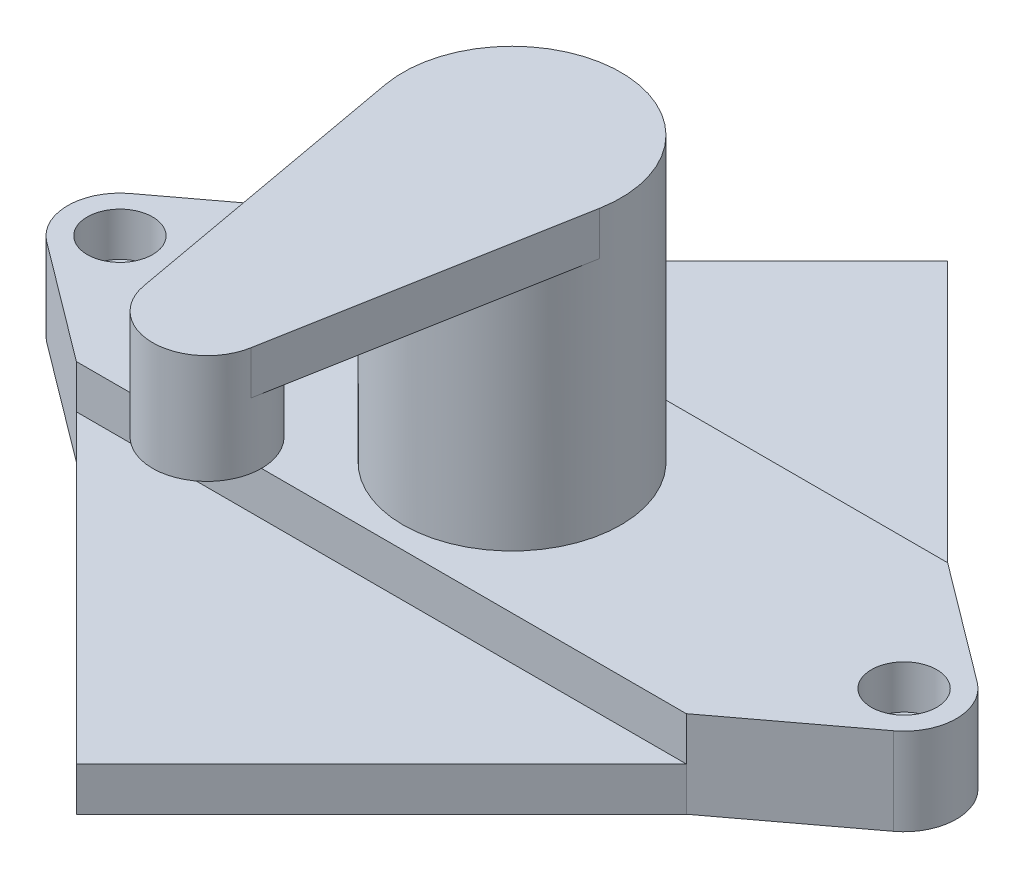
ISO-10303-21;
HEADER;
FILE_DESCRIPTION(('STEP AP214'),'2;1');
FILE_NAME('part.step','',(''),(''),'','','');
FILE_SCHEMA(('AUTOMOTIVE_DESIGN { 1 0 10303 214 1 1 1 1 }'));
ENDSEC;
DATA;
#1=APPLICATION_CONTEXT('core data for automotive mechanical design processes');
#2=APPLICATION_PROTOCOL_DEFINITION('international standard','automotive_design',2000,#1);
#3=PRODUCT_CONTEXT('',#1,'mechanical');
#4=PRODUCT('Part','Part','',(#3));
#5=PRODUCT_RELATED_PRODUCT_CATEGORY('part','',(#4));
#6=PRODUCT_DEFINITION_FORMATION('','',#4);
#7=PRODUCT_DEFINITION_CONTEXT('part definition',#1,'design');
#8=PRODUCT_DEFINITION('design','',#6,#7);
#9=PRODUCT_DEFINITION_SHAPE('','',#8);
#10=(LENGTH_UNIT() NAMED_UNIT(*) SI_UNIT(.MILLI.,.METRE.));
#11=(NAMED_UNIT(*) PLANE_ANGLE_UNIT() SI_UNIT($,.RADIAN.));
#12=(NAMED_UNIT(*) SI_UNIT($,.STERADIAN.) SOLID_ANGLE_UNIT());
#13=UNCERTAINTY_MEASURE_WITH_UNIT(LENGTH_MEASURE(1.E-05),#10,'distance_accuracy_value','');
#14=(GEOMETRIC_REPRESENTATION_CONTEXT(3) GLOBAL_UNCERTAINTY_ASSIGNED_CONTEXT((#13)) GLOBAL_UNIT_ASSIGNED_CONTEXT((#10,
#11,#12)) REPRESENTATION_CONTEXT('',''));
#15=CARTESIAN_POINT('',(0.,0.,0.));
#16=DIRECTION('',(0.,0.,1.));
#17=DIRECTION('',(1.,0.,0.));
#18=AXIS2_PLACEMENT_3D('',#15,#16,#17);
#19=CARTESIAN_POINT('',(0.,85.,0.));
#20=DIRECTION('',(0.,-1.,0.));
#21=DIRECTION('',(0.,0.,-1.));
#22=AXIS2_PLACEMENT_3D('',#19,#20,#21);
#23=CYLINDRICAL_SURFACE('',#22,25.);
#24=CARTESIAN_POINT('',(0.,20.,0.));
#25=DIRECTION('',(0.,1.,0.));
#26=DIRECTION('',(0.,0.,1.));
#27=AXIS2_PLACEMENT_3D('',#24,#25,#26);
#28=CIRCLE('',#27,25.);
#29=CARTESIAN_POINT('',(0.,20.,25.));
#30=VERTEX_POINT('',#29);
#31=EDGE_CURVE('E228',#30,#30,#28,.T.);
#32=ORIENTED_EDGE('',*,*,#31,.T.);
#33=EDGE_LOOP('',(#32));
#34=FACE_BOUND('',#33,.T.);
#35=DIRECTION('',(0.,1.,0.));
#36=VECTOR('',#35,1.);
#37=CARTESIAN_POINT('',(-24.5981737749213,75.,4.46428571428572));
#38=LINE('',#37,#36);
#39=CARTESIAN_POINT('',(-24.5981737749213,75.,4.46428571428572));
#40=VERTEX_POINT('',#39);
#41=CARTESIAN_POINT('',(-24.5981737749213,85.,4.46428571428572));
#42=VERTEX_POINT('',#41);
#43=EDGE_CURVE('E191',#40,#42,#38,.T.);
#44=ORIENTED_EDGE('',*,*,#43,.T.);
#45=CARTESIAN_POINT('',(0.,85.,0.));
#46=DIRECTION('',(0.,1.,0.));
#47=DIRECTION('',(0.,0.,1.));
#48=AXIS2_PLACEMENT_3D('',#45,#46,#47);
#49=CIRCLE('',#48,25.);
#50=CARTESIAN_POINT('',(24.5981737749213,85.,4.46428571428572));
#51=VERTEX_POINT('',#50);
#52=EDGE_CURVE('E190',#51,#42,#49,.T.);
#53=ORIENTED_EDGE('',*,*,#52,.F.);
#54=DIRECTION('',(0.,1.,0.));
#55=VECTOR('',#54,1.);
#56=CARTESIAN_POINT('',(24.5981737749213,75.,4.46428571428572));
#57=LINE('',#56,#55);
#58=CARTESIAN_POINT('',(24.5981737749213,75.,4.46428571428572));
#59=VERTEX_POINT('',#58);
#60=EDGE_CURVE('E164',#59,#51,#57,.T.);
#61=ORIENTED_EDGE('',*,*,#60,.F.);
#62=CARTESIAN_POINT('',(0.,75.,0.));
#63=DIRECTION('',(0.,1.,0.));
#64=DIRECTION('',(0.,0.,1.));
#65=AXIS2_PLACEMENT_3D('',#62,#63,#64);
#66=CIRCLE('',#65,25.);
#67=EDGE_CURVE('E486',#40,#59,#66,.T.);
#68=ORIENTED_EDGE('',*,*,#67,.F.);
#69=EDGE_LOOP('',(#44,#53,#61,#68));
#70=FACE_BOUND('',#69,.T.);
#71=ADVANCED_FACE('F39',(#34,#70),#23,.T.);
#72=CARTESIAN_POINT('',(-50.,10.,50.));
#73=DIRECTION('',(0.707106781186547,0.,-0.707106781186548));
#74=DIRECTION('',(-0.707106781186548,0.,-0.707106781186547));
#75=AXIS2_PLACEMENT_3D('',#72,#73,#74);
#76=PLANE('',#75);
#77=DIRECTION('',(0.707106781186548,0.,0.707106781186547));
#78=VECTOR('',#77,1.);
#79=CARTESIAN_POINT('',(-50.,0.,50.));
#80=LINE('',#79,#78);
#81=CARTESIAN_POINT('',(-70.,0.,30.));
#82=VERTEX_POINT('',#81);
#83=CARTESIAN_POINT('',(0.,0.,100.));
#84=VERTEX_POINT('',#83);
#85=EDGE_CURVE('E312',#82,#84,#80,.T.);
#86=ORIENTED_EDGE('',*,*,#85,.T.);
#87=DIRECTION('',(0.,-1.,0.));
#88=VECTOR('',#87,1.);
#89=CARTESIAN_POINT('',(0.,10.,100.));
#90=LINE('',#89,#88);
#91=CARTESIAN_POINT('',(0.,10.,100.));
#92=VERTEX_POINT('',#91);
#93=EDGE_CURVE('E11',#92,#84,#90,.T.);
#94=ORIENTED_EDGE('',*,*,#93,.F.);
#95=DIRECTION('',(0.707106781186548,0.,0.707106781186547));
#96=VECTOR('',#95,1.);
#97=CARTESIAN_POINT('',(-50.,10.,50.));
#98=LINE('',#97,#96);
#99=CARTESIAN_POINT('',(-70.,10.,30.));
#100=VERTEX_POINT('',#99);
#101=EDGE_CURVE('E313',#100,#92,#98,.T.);
#102=ORIENTED_EDGE('',*,*,#101,.F.);
#103=DIRECTION('',(0.,-1.,0.));
#104=VECTOR('',#103,1.);
#105=CARTESIAN_POINT('',(-70.,10.,30.));
#106=LINE('',#105,#104);
#107=EDGE_CURVE('E326',#100,#82,#106,.T.);
#108=ORIENTED_EDGE('',*,*,#107,.T.);
#109=EDGE_LOOP('',(#86,#94,#102,#108));
#110=FACE_BOUND('',#109,.T.);
#111=ADVANCED_FACE('F41',(#110),#76,.F.);
#112=CARTESIAN_POINT('',(50.,10.,50.));
#113=DIRECTION('',(-0.707106781186548,0.,-0.707106781186548));
#114=DIRECTION('',(-0.707106781186548,0.,0.707106781186548));
#115=AXIS2_PLACEMENT_3D('',#112,#113,#114);
#116=PLANE('',#115);
#117=DIRECTION('',(0.707106781186548,0.,-0.707106781186548));
#118=VECTOR('',#117,1.);
#119=CARTESIAN_POINT('',(50.,0.,50.));
#120=LINE('',#119,#118);
#121=CARTESIAN_POINT('',(70.,0.,30.));
#122=VERTEX_POINT('',#121);
#123=EDGE_CURVE('E318',#84,#122,#120,.T.);
#124=ORIENTED_EDGE('',*,*,#123,.T.);
#125=DIRECTION('',(0.,-1.,0.));
#126=VECTOR('',#125,1.);
#127=CARTESIAN_POINT('',(70.,10.,30.));
#128=LINE('',#127,#126);
#129=CARTESIAN_POINT('',(70.,10.,30.));
#130=VERTEX_POINT('',#129);
#131=EDGE_CURVE('E48',#130,#122,#128,.T.);
#132=ORIENTED_EDGE('',*,*,#131,.F.);
#133=DIRECTION('',(0.707106781186548,0.,-0.707106781186548));
#134=VECTOR('',#133,1.);
#135=CARTESIAN_POINT('',(50.,10.,50.));
#136=LINE('',#135,#134);
#137=EDGE_CURVE('E317',#92,#130,#136,.T.);
#138=ORIENTED_EDGE('',*,*,#137,.F.);
#139=ORIENTED_EDGE('',*,*,#93,.T.);
#140=EDGE_LOOP('',(#124,#132,#138,#139));
#141=FACE_BOUND('',#140,.T.);
#142=ADVANCED_FACE('F402',(#141),#116,.F.);
#143=CARTESIAN_POINT('',(0.,10.,0.));
#144=DIRECTION('',(0.,1.,0.));
#145=DIRECTION('',(0.,0.,1.));
#146=AXIS2_PLACEMENT_3D('',#143,#144,#145);
#147=PLANE('',#146);
#148=ORIENTED_EDGE('',*,*,#101,.T.);
#149=ORIENTED_EDGE('',*,*,#137,.T.);
#150=DIRECTION('',(1.,0.,0.));
#151=VECTOR('',#150,1.);
#152=CARTESIAN_POINT('',(0.,10.,30.));
#153=LINE('',#152,#151);
#154=EDGE_CURVE('E322',#100,#130,#153,.T.);
#155=ORIENTED_EDGE('',*,*,#154,.F.);
#156=EDGE_LOOP('',(#148,#149,#155));
#157=FACE_BOUND('',#156,.T.);
#158=ADVANCED_FACE('F359',(#157),#147,.T.);
#159=CARTESIAN_POINT('',(0.,0.,0.));
#160=DIRECTION('',(0.,1.,0.));
#161=DIRECTION('',(0.,0.,1.));
#162=AXIS2_PLACEMENT_3D('',#159,#160,#161);
#163=PLANE('',#162);
#164=CARTESIAN_POINT('',(90.,0.,0.));
#165=DIRECTION('',(0.,1.,0.));
#166=DIRECTION('',(0.,0.,1.));
#167=AXIS2_PLACEMENT_3D('',#164,#165,#166);
#168=CIRCLE('',#167,3.499999985);
#169=CARTESIAN_POINT('',(90.,0.,3.499999985));
#170=VERTEX_POINT('',#169);
#171=EDGE_CURVE('E463',#170,#170,#168,.T.);
#172=ORIENTED_EDGE('',*,*,#171,.T.);
#173=EDGE_LOOP('',(#172));
#174=FACE_BOUND('',#173,.T.);
#175=CARTESIAN_POINT('',(-90.,0.,0.));
#176=DIRECTION('',(0.,1.,0.));
#177=DIRECTION('',(0.,0.,1.));
#178=AXIS2_PLACEMENT_3D('',#175,#176,#177);
#179=CIRCLE('',#178,3.499999985);
#180=CARTESIAN_POINT('',(-90.,0.,3.499999985));
#181=VERTEX_POINT('',#180);
#182=EDGE_CURVE('E172',#181,#181,#179,.T.);
#183=ORIENTED_EDGE('',*,*,#182,.T.);
#184=EDGE_LOOP('',(#183));
#185=FACE_BOUND('',#184,.T.);
#186=ORIENTED_EDGE('',*,*,#85,.F.);
#187=DIRECTION('',(0.8,0.,0.600000000000001));
#188=VECTOR('',#187,1.);
#189=CARTESIAN_POINT('',(-39.6000000000001,0.,52.8));
#190=LINE('',#189,#188);
#191=CARTESIAN_POINT('',(-97.2,0.,9.59999999999999));
#192=VERTEX_POINT('',#191);
#193=EDGE_CURVE('E271',#192,#82,#190,.T.);
#194=ORIENTED_EDGE('',*,*,#193,.F.);
#195=CARTESIAN_POINT('',(-90.,0.,0.));
#196=DIRECTION('',(0.,1.,0.));
#197=DIRECTION('',(0.,0.,1.));
#198=AXIS2_PLACEMENT_3D('',#195,#196,#197);
#199=CIRCLE('',#198,12.);
#200=CARTESIAN_POINT('',(-97.2,0.,-9.59999999999999));
#201=VERTEX_POINT('',#200);
#202=EDGE_CURVE('E267',#201,#192,#199,.T.);
#203=ORIENTED_EDGE('',*,*,#202,.F.);
#204=DIRECTION('',(0.8,0.,-0.6));
#205=VECTOR('',#204,1.);
#206=CARTESIAN_POINT('',(-39.6,0.,-52.8));
#207=LINE('',#206,#205);
#208=CARTESIAN_POINT('',(-70.,0.,-30.));
#209=VERTEX_POINT('',#208);
#210=EDGE_CURVE('E227',#201,#209,#207,.T.);
#211=ORIENTED_EDGE('',*,*,#210,.T.);
#212=DIRECTION('',(0.707106781186547,0.,-0.707106781186548));
#213=VECTOR('',#212,1.);
#214=CARTESIAN_POINT('',(-50.,0.,-50.));
#215=LINE('',#214,#213);
#216=CARTESIAN_POINT('',(0.,0.,-100.));
#217=VERTEX_POINT('',#216);
#218=EDGE_CURVE('E205',#209,#217,#215,.T.);
#219=ORIENTED_EDGE('',*,*,#218,.T.);
#220=DIRECTION('',(0.707106781186548,0.,0.707106781186547));
#221=VECTOR('',#220,1.);
#222=CARTESIAN_POINT('',(50.,0.,-50.));
#223=LINE('',#222,#221);
#224=CARTESIAN_POINT('',(70.,0.,-30.));
#225=VERTEX_POINT('',#224);
#226=EDGE_CURVE('E199',#217,#225,#223,.T.);
#227=ORIENTED_EDGE('',*,*,#226,.T.);
#228=DIRECTION('',(0.8,0.,0.6));
#229=VECTOR('',#228,1.);
#230=CARTESIAN_POINT('',(39.6,0.,-52.8));
#231=LINE('',#230,#229);
#232=CARTESIAN_POINT('',(97.2,0.,-9.60000000000001));
#233=VERTEX_POINT('',#232);
#234=EDGE_CURVE('E233',#225,#233,#231,.T.);
#235=ORIENTED_EDGE('',*,*,#234,.T.);
#236=CARTESIAN_POINT('',(90.,0.,0.));
#237=DIRECTION('',(0.,1.,0.));
#238=DIRECTION('',(0.,0.,1.));
#239=AXIS2_PLACEMENT_3D('',#236,#237,#238);
#240=CIRCLE('',#239,12.);
#241=CARTESIAN_POINT('',(97.2,0.,9.59999999999997));
#242=VERTEX_POINT('',#241);
#243=EDGE_CURVE('E279',#242,#233,#240,.T.);
#244=ORIENTED_EDGE('',*,*,#243,.F.);
#245=DIRECTION('',(-0.8,0.,0.6));
#246=VECTOR('',#245,1.);
#247=CARTESIAN_POINT('',(39.6,0.,52.8));
#248=LINE('',#247,#246);
#249=EDGE_CURVE('E275',#242,#122,#248,.T.);
#250=ORIENTED_EDGE('',*,*,#249,.T.);
#251=ORIENTED_EDGE('',*,*,#123,.F.);
#252=EDGE_LOOP('',(#186,#194,#203,#211,#219,#227,#235,#244,#250,#251));
#253=FACE_BOUND('',#252,.T.);
#254=ADVANCED_FACE('F343',(#174,#185,#253),#163,.F.);
#255=CARTESIAN_POINT('',(0.,20.,30.));
#256=DIRECTION('',(0.,0.,-1.));
#257=DIRECTION('',(-1.,0.,0.));
#258=AXIS2_PLACEMENT_3D('',#255,#256,#257);
#259=PLANE('',#258);
#260=DIRECTION('',(0.,-1.,0.));
#261=VECTOR('',#260,1.);
#262=CARTESIAN_POINT('',(-70.,20.,30.));
#263=LINE('',#262,#261);
#264=CARTESIAN_POINT('',(-70.,20.,30.));
#265=VERTEX_POINT('',#264);
#266=EDGE_CURVE('E301',#265,#100,#263,.T.);
#267=ORIENTED_EDGE('',*,*,#266,.T.);
#268=ORIENTED_EDGE('',*,*,#154,.T.);
#269=DIRECTION('',(0.,-1.,0.));
#270=VECTOR('',#269,1.);
#271=CARTESIAN_POINT('',(70.,20.,30.));
#272=LINE('',#271,#270);
#273=CARTESIAN_POINT('',(70.,20.,30.));
#274=VERTEX_POINT('',#273);
#275=EDGE_CURVE('E297',#274,#130,#272,.T.);
#276=ORIENTED_EDGE('',*,*,#275,.F.);
#277=DIRECTION('',(1.,0.,0.));
#278=VECTOR('',#277,1.);
#279=CARTESIAN_POINT('',(0.,20.,30.));
#280=LINE('',#279,#278);
#281=EDGE_CURVE('E245',#265,#274,#280,.T.);
#282=ORIENTED_EDGE('',*,*,#281,.F.);
#283=EDGE_LOOP('',(#267,#268,#276,#282));
#284=FACE_BOUND('',#283,.T.);
#285=ADVANCED_FACE('F355',(#284),#259,.F.);
#286=CARTESIAN_POINT('',(-39.6,20.,-52.8));
#287=DIRECTION('',(-0.6,0.,-0.8));
#288=DIRECTION('',(-0.8,0.,0.6));
#289=AXIS2_PLACEMENT_3D('',#286,#287,#288);
#290=PLANE('',#289);
#291=ORIENTED_EDGE('',*,*,#210,.F.);
#292=DIRECTION('',(0.,-1.,0.));
#293=VECTOR('',#292,1.);
#294=CARTESIAN_POINT('',(-97.2,20.,-9.59999999999999));
#295=LINE('',#294,#293);
#296=CARTESIAN_POINT('',(-97.2,20.,-9.59999999999999));
#297=VERTEX_POINT('',#296);
#298=EDGE_CURVE('E309',#297,#201,#295,.T.);
#299=ORIENTED_EDGE('',*,*,#298,.F.);
#300=DIRECTION('',(0.8,0.,-0.6));
#301=VECTOR('',#300,1.);
#302=CARTESIAN_POINT('',(-39.6,20.,-52.8));
#303=LINE('',#302,#301);
#304=CARTESIAN_POINT('',(-70.,20.,-30.));
#305=VERTEX_POINT('',#304);
#306=EDGE_CURVE('E232',#297,#305,#303,.T.);
#307=ORIENTED_EDGE('',*,*,#306,.T.);
#308=DIRECTION('',(0.,-1.,0.));
#309=VECTOR('',#308,1.);
#310=CARTESIAN_POINT('',(-70.,20.,-30.));
#311=LINE('',#310,#309);
#312=CARTESIAN_POINT('',(-70.,10.,-30.));
#313=VERTEX_POINT('',#312);
#314=EDGE_CURVE('E263',#305,#313,#311,.T.);
#315=ORIENTED_EDGE('',*,*,#314,.T.);
#316=DIRECTION('',(0.,-1.,0.));
#317=VECTOR('',#316,1.);
#318=CARTESIAN_POINT('',(-70.,10.,-30.));
#319=LINE('',#318,#317);
#320=EDGE_CURVE('E221',#313,#209,#319,.T.);
#321=ORIENTED_EDGE('',*,*,#320,.T.);
#322=EDGE_LOOP('',(#291,#299,#307,#315,#321));
#323=FACE_BOUND('',#322,.T.);
#324=ADVANCED_FACE('F371',(#323),#290,.T.);
#325=CARTESIAN_POINT('',(-90.,20.,0.));
#326=DIRECTION('',(0.,-1.,0.));
#327=DIRECTION('',(0.,0.,-1.));
#328=AXIS2_PLACEMENT_3D('',#325,#326,#327);
#329=CYLINDRICAL_SURFACE('',#328,12.);
#330=ORIENTED_EDGE('',*,*,#202,.T.);
#331=DIRECTION('',(0.,-1.,0.));
#332=VECTOR('',#331,1.);
#333=CARTESIAN_POINT('',(-97.2,20.,9.59999999999999));
#334=LINE('',#333,#332);
#335=CARTESIAN_POINT('',(-97.2,20.,9.59999999999999));
#336=VERTEX_POINT('',#335);
#337=EDGE_CURVE('E305',#336,#192,#334,.T.);
#338=ORIENTED_EDGE('',*,*,#337,.F.);
#339=CARTESIAN_POINT('',(-90.,20.,0.));
#340=DIRECTION('',(0.,1.,0.));
#341=DIRECTION('',(0.,0.,1.));
#342=AXIS2_PLACEMENT_3D('',#339,#340,#341);
#343=CIRCLE('',#342,12.);
#344=EDGE_CURVE('E237',#297,#336,#343,.T.);
#345=ORIENTED_EDGE('',*,*,#344,.F.);
#346=ORIENTED_EDGE('',*,*,#298,.T.);
#347=EDGE_LOOP('',(#330,#338,#345,#346));
#348=FACE_BOUND('',#347,.T.);
#349=ADVANCED_FACE('F369',(#348),#329,.T.);
#350=CARTESIAN_POINT('',(-39.6000000000001,20.,52.8));
#351=DIRECTION('',(0.600000000000001,0.,-0.8));
#352=DIRECTION('',(-0.8,0.,-0.600000000000001));
#353=AXIS2_PLACEMENT_3D('',#350,#351,#352);
#354=PLANE('',#353);
#355=ORIENTED_EDGE('',*,*,#193,.T.);
#356=ORIENTED_EDGE('',*,*,#107,.F.);
#357=ORIENTED_EDGE('',*,*,#266,.F.);
#358=DIRECTION('',(0.8,0.,0.600000000000001));
#359=VECTOR('',#358,1.);
#360=CARTESIAN_POINT('',(-39.6000000000001,20.,52.8));
#361=LINE('',#360,#359);
#362=EDGE_CURVE('E241',#336,#265,#361,.T.);
#363=ORIENTED_EDGE('',*,*,#362,.F.);
#364=ORIENTED_EDGE('',*,*,#337,.T.);
#365=EDGE_LOOP('',(#355,#356,#357,#363,#364));
#366=FACE_BOUND('',#365,.T.);
#367=ADVANCED_FACE('F362',(#366),#354,.F.);
#368=CARTESIAN_POINT('',(39.6,20.,52.8));
#369=DIRECTION('',(0.6,0.,0.8));
#370=DIRECTION('',(0.8,0.,-0.6));
#371=AXIS2_PLACEMENT_3D('',#368,#369,#370);
#372=PLANE('',#371);
#373=ORIENTED_EDGE('',*,*,#249,.F.);
#374=DIRECTION('',(0.,-1.,0.));
#375=VECTOR('',#374,1.);
#376=CARTESIAN_POINT('',(97.2,20.,9.59999999999997));
#377=LINE('',#376,#375);
#378=CARTESIAN_POINT('',(97.2,20.,9.59999999999997));
#379=VERTEX_POINT('',#378);
#380=EDGE_CURVE('E294',#379,#242,#377,.T.);
#381=ORIENTED_EDGE('',*,*,#380,.F.);
#382=DIRECTION('',(-0.8,0.,0.6));
#383=VECTOR('',#382,1.);
#384=CARTESIAN_POINT('',(39.6,20.,52.8));
#385=LINE('',#384,#383);
#386=EDGE_CURVE('E248',#379,#274,#385,.T.);
#387=ORIENTED_EDGE('',*,*,#386,.T.);
#388=ORIENTED_EDGE('',*,*,#275,.T.);
#389=ORIENTED_EDGE('',*,*,#131,.T.);
#390=EDGE_LOOP('',(#373,#381,#387,#388,#389));
#391=FACE_BOUND('',#390,.T.);
#392=ADVANCED_FACE('F337',(#391),#372,.T.);
#393=CARTESIAN_POINT('',(90.,20.,0.));
#394=DIRECTION('',(0.,-1.,0.));
#395=DIRECTION('',(0.,0.,-1.));
#396=AXIS2_PLACEMENT_3D('',#393,#394,#395);
#397=CYLINDRICAL_SURFACE('',#396,12.);
#398=ORIENTED_EDGE('',*,*,#243,.T.);
#399=DIRECTION('',(0.,-1.,0.));
#400=VECTOR('',#399,1.);
#401=CARTESIAN_POINT('',(97.2,20.,-9.60000000000001));
#402=LINE('',#401,#400);
#403=CARTESIAN_POINT('',(97.2,20.,-9.60000000000001));
#404=VERTEX_POINT('',#403);
#405=EDGE_CURVE('E291',#404,#233,#402,.T.);
#406=ORIENTED_EDGE('',*,*,#405,.F.);
#407=CARTESIAN_POINT('',(90.,20.,0.));
#408=DIRECTION('',(0.,1.,0.));
#409=DIRECTION('',(0.,0.,1.));
#410=AXIS2_PLACEMENT_3D('',#407,#408,#409);
#411=CIRCLE('',#410,12.);
#412=EDGE_CURVE('E252',#379,#404,#411,.T.);
#413=ORIENTED_EDGE('',*,*,#412,.F.);
#414=ORIENTED_EDGE('',*,*,#380,.T.);
#415=EDGE_LOOP('',(#398,#406,#413,#414));
#416=FACE_BOUND('',#415,.T.);
#417=ADVANCED_FACE('F346',(#416),#397,.T.);
#418=CARTESIAN_POINT('',(39.6,20.,-52.8));
#419=DIRECTION('',(0.6,0.,-0.8));
#420=DIRECTION('',(-0.8,0.,-0.6));
#421=AXIS2_PLACEMENT_3D('',#418,#419,#420);
#422=PLANE('',#421);
#423=ORIENTED_EDGE('',*,*,#234,.F.);
#424=DIRECTION('',(0.,-1.,0.));
#425=VECTOR('',#424,1.);
#426=CARTESIAN_POINT('',(70.,10.,-30.));
#427=LINE('',#426,#425);
#428=CARTESIAN_POINT('',(70.,10.,-30.));
#429=VERTEX_POINT('',#428);
#430=EDGE_CURVE('E211',#429,#225,#427,.T.);
#431=ORIENTED_EDGE('',*,*,#430,.F.);
#432=DIRECTION('',(0.,-1.,0.));
#433=VECTOR('',#432,1.);
#434=CARTESIAN_POINT('',(70.,20.,-30.));
#435=LINE('',#434,#433);
#436=CARTESIAN_POINT('',(70.,20.,-30.));
#437=VERTEX_POINT('',#436);
#438=EDGE_CURVE('E288',#437,#429,#435,.T.);
#439=ORIENTED_EDGE('',*,*,#438,.F.);
#440=DIRECTION('',(0.8,0.,0.6));
#441=VECTOR('',#440,1.);
#442=CARTESIAN_POINT('',(39.6,20.,-52.8));
#443=LINE('',#442,#441);
#444=EDGE_CURVE('E255',#437,#404,#443,.T.);
#445=ORIENTED_EDGE('',*,*,#444,.T.);
#446=ORIENTED_EDGE('',*,*,#405,.T.);
#447=EDGE_LOOP('',(#423,#431,#439,#445,#446));
#448=FACE_BOUND('',#447,.T.);
#449=ADVANCED_FACE('F384',(#448),#422,.T.);
#450=CARTESIAN_POINT('',(0.,20.,-30.));
#451=DIRECTION('',(0.,0.,-1.));
#452=DIRECTION('',(-1.,0.,0.));
#453=AXIS2_PLACEMENT_3D('',#450,#451,#452);
#454=PLANE('',#453);
#455=DIRECTION('',(1.,0.,0.));
#456=VECTOR('',#455,1.);
#457=CARTESIAN_POINT('',(0.,10.,-30.));
#458=LINE('',#457,#456);
#459=EDGE_CURVE('E63',#313,#429,#458,.T.);
#460=ORIENTED_EDGE('',*,*,#459,.F.);
#461=ORIENTED_EDGE('',*,*,#314,.F.);
#462=DIRECTION('',(1.,0.,0.));
#463=VECTOR('',#462,1.);
#464=CARTESIAN_POINT('',(0.,20.,-30.));
#465=LINE('',#464,#463);
#466=EDGE_CURVE('E259',#305,#437,#465,.T.);
#467=ORIENTED_EDGE('',*,*,#466,.T.);
#468=ORIENTED_EDGE('',*,*,#438,.T.);
#469=EDGE_LOOP('',(#460,#461,#467,#468));
#470=FACE_BOUND('',#469,.T.);
#471=ADVANCED_FACE('F503',(#470),#454,.T.);
#472=CARTESIAN_POINT('',(0.,20.,0.));
#473=DIRECTION('',(0.,1.,0.));
#474=DIRECTION('',(0.,0.,1.));
#475=AXIS2_PLACEMENT_3D('',#472,#473,#474);
#476=PLANE('',#475);
#477=CARTESIAN_POINT('',(90.,20.,0.));
#478=DIRECTION('',(0.,1.,0.));
#479=DIRECTION('',(0.,0.,1.));
#480=AXIS2_PLACEMENT_3D('',#477,#478,#479);
#481=CIRCLE('',#480,7.499999986);
#482=CARTESIAN_POINT('',(90.,20.,7.499999986));
#483=VERTEX_POINT('',#482);
#484=EDGE_CURVE('E452',#483,#483,#481,.T.);
#485=ORIENTED_EDGE('',*,*,#484,.F.);
#486=EDGE_LOOP('',(#485));
#487=FACE_BOUND('',#486,.T.);
#488=CARTESIAN_POINT('',(-90.,20.,0.));
#489=DIRECTION('',(0.,1.,0.));
#490=DIRECTION('',(0.,0.,1.));
#491=AXIS2_PLACEMENT_3D('',#488,#489,#490);
#492=CIRCLE('',#491,7.499999986);
#493=CARTESIAN_POINT('',(-90.,20.,7.499999986));
#494=VERTEX_POINT('',#493);
#495=EDGE_CURVE('E467',#494,#494,#492,.T.);
#496=ORIENTED_EDGE('',*,*,#495,.F.);
#497=EDGE_LOOP('',(#496));
#498=FACE_BOUND('',#497,.T.);
#499=ORIENTED_EDGE('',*,*,#31,.F.);
#500=EDGE_LOOP('',(#499));
#501=FACE_BOUND('',#500,.T.);
#502=ORIENTED_EDGE('',*,*,#306,.F.);
#503=ORIENTED_EDGE('',*,*,#344,.T.);
#504=ORIENTED_EDGE('',*,*,#362,.T.);
#505=ORIENTED_EDGE('',*,*,#281,.T.);
#506=ORIENTED_EDGE('',*,*,#386,.F.);
#507=ORIENTED_EDGE('',*,*,#412,.T.);
#508=ORIENTED_EDGE('',*,*,#444,.F.);
#509=ORIENTED_EDGE('',*,*,#466,.F.);
#510=EDGE_LOOP('',(#502,#503,#504,#505,#506,#507,#508,#509));
#511=FACE_BOUND('',#510,.T.);
#512=ADVANCED_FACE('F351',(#487,#498,#501,#511),#476,.T.);
#513=CARTESIAN_POINT('',(50.,10.,-50.));
#514=DIRECTION('',(0.707106781186547,0.,-0.707106781186548));
#515=DIRECTION('',(-0.707106781186548,0.,-0.707106781186547));
#516=AXIS2_PLACEMENT_3D('',#513,#514,#515);
#517=PLANE('',#516);
#518=ORIENTED_EDGE('',*,*,#226,.F.);
#519=DIRECTION('',(0.,-1.,0.));
#520=VECTOR('',#519,1.);
#521=CARTESIAN_POINT('',(0.,10.,-100.));
#522=LINE('',#521,#520);
#523=CARTESIAN_POINT('',(0.,10.,-100.));
#524=VERTEX_POINT('',#523);
#525=EDGE_CURVE('E224',#524,#217,#522,.T.);
#526=ORIENTED_EDGE('',*,*,#525,.F.);
#527=DIRECTION('',(0.707106781186548,0.,0.707106781186547));
#528=VECTOR('',#527,1.);
#529=CARTESIAN_POINT('',(50.,10.,-50.));
#530=LINE('',#529,#528);
#531=EDGE_CURVE('E200',#524,#429,#530,.T.);
#532=ORIENTED_EDGE('',*,*,#531,.T.);
#533=ORIENTED_EDGE('',*,*,#430,.T.);
#534=EDGE_LOOP('',(#518,#526,#532,#533));
#535=FACE_BOUND('',#534,.T.);
#536=ADVANCED_FACE('F381',(#535),#517,.T.);
#537=CARTESIAN_POINT('',(-50.,10.,-50.));
#538=DIRECTION('',(-0.707106781186548,0.,-0.707106781186547));
#539=DIRECTION('',(-0.707106781186547,0.,0.707106781186548));
#540=AXIS2_PLACEMENT_3D('',#537,#538,#539);
#541=PLANE('',#540);
#542=ORIENTED_EDGE('',*,*,#218,.F.);
#543=ORIENTED_EDGE('',*,*,#320,.F.);
#544=DIRECTION('',(0.707106781186547,0.,-0.707106781186548));
#545=VECTOR('',#544,1.);
#546=CARTESIAN_POINT('',(-50.,10.,-50.));
#547=LINE('',#546,#545);
#548=EDGE_CURVE('E204',#313,#524,#547,.T.);
#549=ORIENTED_EDGE('',*,*,#548,.T.);
#550=ORIENTED_EDGE('',*,*,#525,.T.);
#551=EDGE_LOOP('',(#542,#543,#549,#550));
#552=FACE_BOUND('',#551,.T.);
#553=ADVANCED_FACE('F376',(#552),#541,.T.);
#554=CARTESIAN_POINT('',(0.,10.,0.));
#555=DIRECTION('',(0.,1.,0.));
#556=DIRECTION('',(0.,0.,1.));
#557=AXIS2_PLACEMENT_3D('',#554,#555,#556);
#558=PLANE('',#557);
#559=ORIENTED_EDGE('',*,*,#531,.F.);
#560=ORIENTED_EDGE('',*,*,#548,.F.);
#561=ORIENTED_EDGE('',*,*,#459,.T.);
#562=EDGE_LOOP('',(#559,#560,#561));
#563=FACE_BOUND('',#562,.T.);
#564=ADVANCED_FACE('F386',(#563),#558,.T.);
#565=CARTESIAN_POINT('',(0.,85.,0.));
#566=DIRECTION('',(0.,1.,0.));
#567=DIRECTION('',(0.,0.,1.));
#568=AXIS2_PLACEMENT_3D('',#565,#566,#567);
#569=PLANE('',#568);
#570=ORIENTED_EDGE('',*,*,#52,.T.);
#571=DIRECTION('',(0.178571428571429,0.,0.983926950996851));
#572=VECTOR('',#571,1.);
#573=CARTESIAN_POINT('',(-24.5981737749213,85.,4.46428571428571));
#574=LINE('',#573,#572);
#575=CARTESIAN_POINT('',(-12.2990868874606,85.,72.2321428571429));
#576=VERTEX_POINT('',#575);
#577=EDGE_CURVE('E169',#42,#576,#574,.T.);
#578=ORIENTED_EDGE('',*,*,#577,.T.);
#579=CARTESIAN_POINT('',(0.,85.,70.));
#580=DIRECTION('',(0.,1.,0.));
#581=DIRECTION('',(0.,0.,1.));
#582=AXIS2_PLACEMENT_3D('',#579,#580,#581);
#583=CIRCLE('',#582,12.5);
#584=CARTESIAN_POINT('',(12.2990868874606,85.,72.2321428571429));
#585=VERTEX_POINT('',#584);
#586=EDGE_CURVE('E156',#576,#585,#583,.T.);
#587=ORIENTED_EDGE('',*,*,#586,.T.);
#588=DIRECTION('',(-0.178571428571429,0.,0.983926950996851));
#589=VECTOR('',#588,1.);
#590=CARTESIAN_POINT('',(24.5981737749213,85.,4.46428571428571));
#591=LINE('',#590,#589);
#592=EDGE_CURVE('E55',#51,#585,#591,.T.);
#593=ORIENTED_EDGE('',*,*,#592,.F.);
#594=EDGE_LOOP('',(#570,#578,#587,#593));
#595=FACE_BOUND('',#594,.T.);
#596=ADVANCED_FACE('F168',(#595),#569,.T.);
#597=CARTESIAN_POINT('',(-24.5981737749213,75.,4.46428571428571));
#598=DIRECTION('',(-0.983926950996851,0.,0.178571428571428));
#599=DIRECTION('',(0.178571428571428,0.,0.983926950996851));
#600=AXIS2_PLACEMENT_3D('',#597,#598,#599);
#601=PLANE('',#600);
#602=ORIENTED_EDGE('',*,*,#577,.F.);
#603=ORIENTED_EDGE('',*,*,#43,.F.);
#604=DIRECTION('',(0.178571428571429,0.,0.983926950996851));
#605=VECTOR('',#604,1.);
#606=CARTESIAN_POINT('',(-24.5981737749213,75.,4.46428571428571));
#607=LINE('',#606,#605);
#608=CARTESIAN_POINT('',(-12.2990868874606,75.,72.2321428571429));
#609=VERTEX_POINT('',#608);
#610=EDGE_CURVE('E165',#40,#609,#607,.T.);
#611=ORIENTED_EDGE('',*,*,#610,.T.);
#612=DIRECTION('',(0.,1.,0.));
#613=VECTOR('',#612,1.);
#614=CARTESIAN_POINT('',(-12.2990868874606,75.,72.2321428571429));
#615=LINE('',#614,#613);
#616=EDGE_CURVE('E187',#609,#576,#615,.T.);
#617=ORIENTED_EDGE('',*,*,#616,.T.);
#618=EDGE_LOOP('',(#602,#603,#611,#617));
#619=FACE_BOUND('',#618,.T.);
#620=ADVANCED_FACE('F393',(#619),#601,.T.);
#621=CARTESIAN_POINT('',(24.5981737749213,75.,4.46428571428571));
#622=DIRECTION('',(-0.983926950996851,0.,-0.178571428571428));
#623=DIRECTION('',(-0.178571428571428,0.,0.983926950996851));
#624=AXIS2_PLACEMENT_3D('',#621,#622,#623);
#625=PLANE('',#624);
#626=ORIENTED_EDGE('',*,*,#592,.T.);
#627=DIRECTION('',(0.,1.,0.));
#628=VECTOR('',#627,1.);
#629=CARTESIAN_POINT('',(12.2990868874606,75.,72.2321428571429));
#630=LINE('',#629,#628);
#631=CARTESIAN_POINT('',(12.2990868874606,75.,72.2321428571429));
#632=VERTEX_POINT('',#631);
#633=EDGE_CURVE('E154',#632,#585,#630,.T.);
#634=ORIENTED_EDGE('',*,*,#633,.F.);
#635=DIRECTION('',(-0.178571428571429,0.,0.983926950996851));
#636=VECTOR('',#635,1.);
#637=CARTESIAN_POINT('',(24.5981737749213,75.,4.46428571428571));
#638=LINE('',#637,#636);
#639=EDGE_CURVE('E484',#59,#632,#638,.T.);
#640=ORIENTED_EDGE('',*,*,#639,.F.);
#641=ORIENTED_EDGE('',*,*,#60,.T.);
#642=EDGE_LOOP('',(#626,#634,#640,#641));
#643=FACE_BOUND('',#642,.T.);
#644=ADVANCED_FACE('F174',(#643),#625,.F.);
#645=CARTESIAN_POINT('',(0.,75.,0.));
#646=DIRECTION('',(0.,1.,0.));
#647=DIRECTION('',(0.,0.,1.));
#648=AXIS2_PLACEMENT_3D('',#645,#646,#647);
#649=PLANE('',#648);
#650=CARTESIAN_POINT('',(0.,75.,70.));
#651=DIRECTION('',(0.,1.,0.));
#652=DIRECTION('',(0.,0.,1.));
#653=AXIS2_PLACEMENT_3D('',#650,#651,#652);
#654=CIRCLE('',#653,12.5);
#655=EDGE_CURVE('E159',#632,#609,#654,.T.);
#656=ORIENTED_EDGE('',*,*,#655,.T.);
#657=ORIENTED_EDGE('',*,*,#610,.F.);
#658=ORIENTED_EDGE('',*,*,#67,.T.);
#659=ORIENTED_EDGE('',*,*,#639,.T.);
#660=EDGE_LOOP('',(#656,#657,#658,#659));
#661=FACE_BOUND('',#660,.T.);
#662=ADVANCED_FACE('F407',(#661),#649,.F.);
#663=CARTESIAN_POINT('',(0.,60.,70.));
#664=DIRECTION('',(0.,1.,0.));
#665=DIRECTION('',(0.,0.,1.));
#666=AXIS2_PLACEMENT_3D('',#663,#664,#665);
#667=CYLINDRICAL_SURFACE('',#666,12.5);
#668=CARTESIAN_POINT('',(0.,60.,70.));
#669=DIRECTION('',(0.,1.,0.));
#670=DIRECTION('',(0.,0.,1.));
#671=AXIS2_PLACEMENT_3D('',#668,#669,#670);
#672=CIRCLE('',#671,12.5);
#673=CARTESIAN_POINT('',(0.,60.,82.5));
#674=VERTEX_POINT('',#673);
#675=EDGE_CURVE('E171',#674,#674,#672,.T.);
#676=ORIENTED_EDGE('',*,*,#675,.T.);
#677=EDGE_LOOP('',(#676));
#678=FACE_BOUND('',#677,.T.);
#679=ORIENTED_EDGE('',*,*,#616,.F.);
#680=ORIENTED_EDGE('',*,*,#655,.F.);
#681=ORIENTED_EDGE('',*,*,#633,.T.);
#682=ORIENTED_EDGE('',*,*,#586,.F.);
#683=EDGE_LOOP('',(#679,#680,#681,#682));
#684=FACE_BOUND('',#683,.T.);
#685=ADVANCED_FACE('F155',(#678,#684),#667,.T.);
#686=CARTESIAN_POINT('',(0.,60.,0.));
#687=DIRECTION('',(0.,1.,0.));
#688=DIRECTION('',(0.,0.,1.));
#689=AXIS2_PLACEMENT_3D('',#686,#687,#688);
#690=PLANE('',#689);
#691=ORIENTED_EDGE('',*,*,#675,.F.);
#692=EDGE_LOOP('',(#691));
#693=FACE_BOUND('',#692,.T.);
#694=ADVANCED_FACE('F416',(#693),#690,.F.);
#695=CARTESIAN_POINT('',(-90.,20.,0.));
#696=DIRECTION('',(0.,1.,0.));
#697=DIRECTION('',(0.,0.,1.));
#698=AXIS2_PLACEMENT_3D('',#695,#696,#697);
#699=CYLINDRICAL_SURFACE('',#698,3.499999985);
#700=ORIENTED_EDGE('',*,*,#182,.F.);
#701=EDGE_LOOP('',(#700));
#702=FACE_BOUND('',#701,.T.);
#703=CARTESIAN_POINT('',(-90.,5.39852636996559,0.));
#704=DIRECTION('',(0.,1.,0.));
#705=DIRECTION('',(0.,0.,1.));
#706=AXIS2_PLACEMENT_3D('',#703,#704,#705);
#707=CIRCLE('',#706,3.499999985);
#708=CARTESIAN_POINT('',(-90.,5.39852636996559,3.499999985));
#709=VERTEX_POINT('',#708);
#710=EDGE_CURVE('E475',#709,#709,#707,.T.);
#711=ORIENTED_EDGE('',*,*,#710,.T.);
#712=EDGE_LOOP('',(#711));
#713=FACE_BOUND('',#712,.T.);
#714=ADVANCED_FACE('F420',(#702,#713),#699,.F.);
#715=CARTESIAN_POINT('',(-90.,10.,0.));
#716=DIRECTION('',(0.,1.,0.));
#717=DIRECTION('',(0.,0.,1.));
#718=AXIS2_PLACEMENT_3D('',#715,#716,#717);
#719=CONICAL_SURFACE('',#718,7.499999986,0.715584993317674);
#720=ORIENTED_EDGE('',*,*,#710,.F.);
#721=EDGE_LOOP('',(#720));
#722=FACE_BOUND('',#721,.T.);
#723=CARTESIAN_POINT('',(-90.,10.,0.));
#724=DIRECTION('',(0.,1.,0.));
#725=DIRECTION('',(0.,0.,1.));
#726=AXIS2_PLACEMENT_3D('',#723,#724,#725);
#727=CIRCLE('',#726,7.499999986);
#728=CARTESIAN_POINT('',(-90.,10.,7.499999986));
#729=VERTEX_POINT('',#728);
#730=EDGE_CURVE('E471',#729,#729,#727,.T.);
#731=ORIENTED_EDGE('',*,*,#730,.T.);
#732=EDGE_LOOP('',(#731));
#733=FACE_BOUND('',#732,.T.);
#734=ADVANCED_FACE('F424',(#722,#733),#719,.F.);
#735=CARTESIAN_POINT('',(-90.,20.,0.));
#736=DIRECTION('',(0.,1.,0.));
#737=DIRECTION('',(0.,0.,1.));
#738=AXIS2_PLACEMENT_3D('',#735,#736,#737);
#739=CYLINDRICAL_SURFACE('',#738,7.499999986);
#740=ORIENTED_EDGE('',*,*,#730,.F.);
#741=EDGE_LOOP('',(#740));
#742=FACE_BOUND('',#741,.T.);
#743=ORIENTED_EDGE('',*,*,#495,.T.);
#744=EDGE_LOOP('',(#743));
#745=FACE_BOUND('',#744,.T.);
#746=ADVANCED_FACE('F428',(#742,#745),#739,.F.);
#747=CARTESIAN_POINT('',(90.,20.,0.));
#748=DIRECTION('',(0.,1.,0.));
#749=DIRECTION('',(0.,0.,1.));
#750=AXIS2_PLACEMENT_3D('',#747,#748,#749);
#751=CYLINDRICAL_SURFACE('',#750,3.499999985);
#752=ORIENTED_EDGE('',*,*,#171,.F.);
#753=EDGE_LOOP('',(#752));
#754=FACE_BOUND('',#753,.T.);
#755=CARTESIAN_POINT('',(90.,5.39852636996559,0.));
#756=DIRECTION('',(0.,1.,0.));
#757=DIRECTION('',(0.,0.,1.));
#758=AXIS2_PLACEMENT_3D('',#755,#756,#757);
#759=CIRCLE('',#758,3.499999985);
#760=CARTESIAN_POINT('',(90.,5.39852636996559,3.499999985));
#761=VERTEX_POINT('',#760);
#762=EDGE_CURVE('E457',#761,#761,#759,.T.);
#763=ORIENTED_EDGE('',*,*,#762,.T.);
#764=EDGE_LOOP('',(#763));
#765=FACE_BOUND('',#764,.T.);
#766=ADVANCED_FACE('F432',(#754,#765),#751,.F.);
#767=CARTESIAN_POINT('',(90.,10.,0.));
#768=DIRECTION('',(0.,1.,0.));
#769=DIRECTION('',(0.,0.,1.));
#770=AXIS2_PLACEMENT_3D('',#767,#768,#769);
#771=CONICAL_SURFACE('',#770,7.499999986,0.715584993317674);
#772=ORIENTED_EDGE('',*,*,#762,.F.);
#773=EDGE_LOOP('',(#772));
#774=FACE_BOUND('',#773,.T.);
#775=CARTESIAN_POINT('',(90.,10.,0.));
#776=DIRECTION('',(0.,1.,0.));
#777=DIRECTION('',(0.,0.,1.));
#778=AXIS2_PLACEMENT_3D('',#775,#776,#777);
#779=CIRCLE('',#778,7.499999986);
#780=CARTESIAN_POINT('',(90.,10.,7.499999986));
#781=VERTEX_POINT('',#780);
#782=EDGE_CURVE('E449',#781,#781,#779,.T.);
#783=ORIENTED_EDGE('',*,*,#782,.T.);
#784=EDGE_LOOP('',(#783));
#785=FACE_BOUND('',#784,.T.);
#786=ADVANCED_FACE('F436',(#774,#785),#771,.F.);
#787=CARTESIAN_POINT('',(90.,20.,0.));
#788=DIRECTION('',(0.,1.,0.));
#789=DIRECTION('',(0.,0.,1.));
#790=AXIS2_PLACEMENT_3D('',#787,#788,#789);
#791=CYLINDRICAL_SURFACE('',#790,7.499999986);
#792=ORIENTED_EDGE('',*,*,#782,.F.);
#793=EDGE_LOOP('',(#792));
#794=FACE_BOUND('',#793,.T.);
#795=ORIENTED_EDGE('',*,*,#484,.T.);
#796=EDGE_LOOP('',(#795));
#797=FACE_BOUND('',#796,.T.);
#798=ADVANCED_FACE('F440',(#794,#797),#791,.F.);
#799=CLOSED_SHELL('',(#71,#111,#142,#158,#254,#285,#324,#349,#367,#392,#417,#449,#471,#512,#536,
#553,#564,#596,#620,#644,#662,#685,#694,#714,#734,#746,#766,#786,#798));
#800=MANIFOLD_SOLID_BREP('B2',#799);
#801=ADVANCED_BREP_SHAPE_REPRESENTATION('',(#18,#800),#14);
#802=SHAPE_DEFINITION_REPRESENTATION(#9,#801);
ENDSEC;
END-ISO-10303-21;
